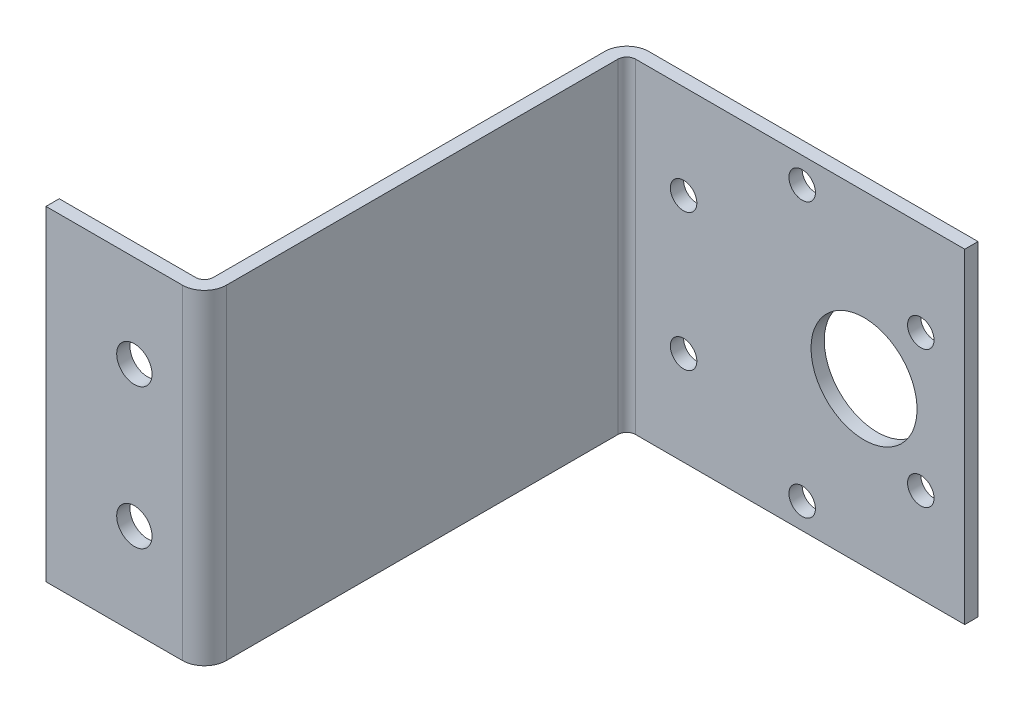
ISO-10303-21;
HEADER;
FILE_DESCRIPTION(('STEP AP214'),'2;1');
FILE_NAME('part.step','',(''),(''),'','','');
FILE_SCHEMA(('AUTOMOTIVE_DESIGN { 1 0 10303 214 1 1 1 1 }'));
ENDSEC;
DATA;
#1=APPLICATION_CONTEXT('core data for automotive mechanical design processes');
#2=APPLICATION_PROTOCOL_DEFINITION('international standard','automotive_design',2000,#1);
#3=PRODUCT_CONTEXT('',#1,'mechanical');
#4=PRODUCT('Part','Part','',(#3));
#5=PRODUCT_RELATED_PRODUCT_CATEGORY('part','',(#4));
#6=PRODUCT_DEFINITION_FORMATION('','',#4);
#7=PRODUCT_DEFINITION_CONTEXT('part definition',#1,'design');
#8=PRODUCT_DEFINITION('design','',#6,#7);
#9=PRODUCT_DEFINITION_SHAPE('','',#8);
#10=(LENGTH_UNIT() NAMED_UNIT(*) SI_UNIT(.MILLI.,.METRE.));
#11=(NAMED_UNIT(*) PLANE_ANGLE_UNIT() SI_UNIT($,.RADIAN.));
#12=(NAMED_UNIT(*) SI_UNIT($,.STERADIAN.) SOLID_ANGLE_UNIT());
#13=UNCERTAINTY_MEASURE_WITH_UNIT(LENGTH_MEASURE(1.E-05),#10,'distance_accuracy_value','');
#14=(GEOMETRIC_REPRESENTATION_CONTEXT(3) GLOBAL_UNCERTAINTY_ASSIGNED_CONTEXT((#13)) GLOBAL_UNIT_ASSIGNED_CONTEXT((#10,
#11,#12)) REPRESENTATION_CONTEXT('',''));
#15=CARTESIAN_POINT('',(0.,0.,0.));
#16=DIRECTION('',(0.,0.,1.));
#17=DIRECTION('',(1.,0.,0.));
#18=AXIS2_PLACEMENT_3D('',#15,#16,#17);
#19=CARTESIAN_POINT('',(-864.924391980611,18.4,1.5));
#20=DIRECTION('',(-1.,0.,0.));
#21=DIRECTION('',(0.,0.,1.));
#22=AXIS2_PLACEMENT_3D('',#19,#20,#21);
#23=PLANE('',#22);
#24=DIRECTION('',(0.,0.,-1.));
#25=VECTOR('',#24,1.);
#26=CARTESIAN_POINT('',(-864.924391980611,-18.4,1.5));
#27=LINE('',#26,#25);
#28=CARTESIAN_POINT('',(-864.924391980611,-18.4,1.5));
#29=VERTEX_POINT('',#28);
#30=CARTESIAN_POINT('',(-864.924391980611,-18.4,0.));
#31=VERTEX_POINT('',#30);
#32=EDGE_CURVE('E139',#29,#31,#27,.T.);
#33=ORIENTED_EDGE('',*,*,#32,.T.);
#34=DIRECTION('',(0.,-1.,0.));
#35=VECTOR('',#34,1.);
#36=CARTESIAN_POINT('',(-864.924391980611,18.4,0.));
#37=LINE('',#36,#35);
#38=CARTESIAN_POINT('',(-864.924391980611,18.4,0.));
#39=VERTEX_POINT('',#38);
#40=EDGE_CURVE('E123',#39,#31,#37,.T.);
#41=ORIENTED_EDGE('',*,*,#40,.F.);
#42=DIRECTION('',(0.,0.,-1.));
#43=VECTOR('',#42,1.);
#44=CARTESIAN_POINT('',(-864.924391980611,18.4,1.5));
#45=LINE('',#44,#43);
#46=CARTESIAN_POINT('',(-864.924391980611,18.4,1.5));
#47=VERTEX_POINT('',#46);
#48=EDGE_CURVE('E126',#47,#39,#45,.T.);
#49=ORIENTED_EDGE('',*,*,#48,.F.);
#50=DIRECTION('',(0.,-1.,0.));
#51=VECTOR('',#50,1.);
#52=CARTESIAN_POINT('',(-864.924391980611,18.4,1.5));
#53=LINE('',#52,#51);
#54=EDGE_CURVE('E230',#47,#29,#53,.T.);
#55=ORIENTED_EDGE('',*,*,#54,.T.);
#56=EDGE_LOOP('',(#33,#41,#49,#55));
#57=FACE_BOUND('',#56,.T.);
#58=ADVANCED_FACE('F33',(#57),#23,.F.);
#59=CARTESIAN_POINT('',(-864.924391980611,18.4,0.));
#60=DIRECTION('',(6.16124264811828E-13,0.,1.));
#61=DIRECTION('',(1.,0.,-6.16124264811828E-13));
#62=AXIS2_PLACEMENT_3D('',#59,#60,#61);
#63=PLANE('',#62);
#64=CARTESIAN_POINT('',(-896.74778573927,7.75000000000018,0.));
#65=DIRECTION('',(0.,0.,-1.));
#66=DIRECTION('',(-1.,0.,0.));
#67=AXIS2_PLACEMENT_3D('',#64,#65,#66);
#68=CIRCLE('',#67,1.50000000000043);
#69=CARTESIAN_POINT('',(-898.24778573927,7.75000000000018,0.));
#70=VERTEX_POINT('',#69);
#71=EDGE_CURVE('E499',#70,#70,#68,.T.);
#72=ORIENTED_EDGE('',*,*,#71,.F.);
#73=EDGE_LOOP('',(#72));
#74=FACE_BOUND('',#73,.T.);
#75=CARTESIAN_POINT('',(-869.900998221952,-7.75,0.));
#76=DIRECTION('',(0.,0.,-1.));
#77=DIRECTION('',(-1.,0.,0.));
#78=AXIS2_PLACEMENT_3D('',#75,#76,#77);
#79=CIRCLE('',#78,1.50000000000008);
#80=CARTESIAN_POINT('',(-871.400998221952,-7.75,0.));
#81=VERTEX_POINT('',#80);
#82=EDGE_CURVE('E503',#81,#81,#79,.T.);
#83=ORIENTED_EDGE('',*,*,#82,.F.);
#84=EDGE_LOOP('',(#83));
#85=FACE_BOUND('',#84,.T.);
#86=CARTESIAN_POINT('',(-896.74778573927,-7.74999999999983,0.));
#87=DIRECTION('',(0.,0.,-1.));
#88=DIRECTION('',(-1.,0.,0.));
#89=AXIS2_PLACEMENT_3D('',#86,#87,#88);
#90=CIRCLE('',#89,1.5000000000002);
#91=CARTESIAN_POINT('',(-898.24778573927,-7.74999999999983,0.));
#92=VERTEX_POINT('',#91);
#93=EDGE_CURVE('E515',#92,#92,#90,.T.);
#94=ORIENTED_EDGE('',*,*,#93,.F.);
#95=EDGE_LOOP('',(#94));
#96=FACE_BOUND('',#95,.T.);
#97=CARTESIAN_POINT('',(-883.324391980611,-15.4999999999999,0.));
#98=DIRECTION('',(0.,0.,-1.));
#99=DIRECTION('',(-1.,0.,0.));
#100=AXIS2_PLACEMENT_3D('',#97,#98,#99);
#101=CIRCLE('',#100,1.49999999999997);
#102=CARTESIAN_POINT('',(-884.824391980611,-15.4999999999999,0.));
#103=VERTEX_POINT('',#102);
#104=EDGE_CURVE('E517',#103,#103,#101,.T.);
#105=ORIENTED_EDGE('',*,*,#104,.F.);
#106=EDGE_LOOP('',(#105));
#107=FACE_BOUND('',#106,.T.);
#108=CARTESIAN_POINT('',(-883.324391980611,15.5,0.));
#109=DIRECTION('',(0.,0.,-1.));
#110=DIRECTION('',(-1.,0.,0.));
#111=AXIS2_PLACEMENT_3D('',#108,#109,#110);
#112=CIRCLE('',#111,1.50000000000066);
#113=CARTESIAN_POINT('',(-884.824391980611,15.5,0.));
#114=VERTEX_POINT('',#113);
#115=EDGE_CURVE('E352',#114,#114,#112,.T.);
#116=ORIENTED_EDGE('',*,*,#115,.F.);
#117=EDGE_LOOP('',(#116));
#118=FACE_BOUND('',#117,.T.);
#119=CARTESIAN_POINT('',(-869.900998221952,7.75,0.));
#120=DIRECTION('',(0.,0.,-1.));
#121=DIRECTION('',(-1.,0.,0.));
#122=AXIS2_PLACEMENT_3D('',#119,#120,#121);
#123=CIRCLE('',#122,1.5000000000002);
#124=CARTESIAN_POINT('',(-871.400998221952,7.75,0.));
#125=VERTEX_POINT('',#124);
#126=EDGE_CURVE('E500',#125,#125,#123,.T.);
#127=ORIENTED_EDGE('',*,*,#126,.F.);
#128=EDGE_LOOP('',(#127));
#129=FACE_BOUND('',#128,.T.);
#130=CARTESIAN_POINT('',(-876.324391980611,0.,0.));
#131=DIRECTION('',(0.,0.,-1.));
#132=DIRECTION('',(-1.,0.,0.));
#133=AXIS2_PLACEMENT_3D('',#130,#131,#132);
#134=CIRCLE('',#133,5.99999999999999);
#135=CARTESIAN_POINT('',(-882.324391980611,0.,0.));
#136=VERTEX_POINT('',#135);
#137=EDGE_CURVE('E155',#136,#136,#134,.T.);
#138=ORIENTED_EDGE('',*,*,#137,.F.);
#139=EDGE_LOOP('',(#138));
#140=FACE_BOUND('',#139,.T.);
#141=DIRECTION('',(-1.,0.,6.16124264811828E-13));
#142=VECTOR('',#141,1.);
#143=CARTESIAN_POINT('',(-864.924391980611,-18.4,0.));
#144=LINE('',#143,#142);
#145=CARTESIAN_POINT('',(-902.179838859942,-18.4,2.29539848187639E-11));
#146=VERTEX_POINT('',#145);
#147=EDGE_CURVE('E216',#31,#146,#144,.T.);
#148=ORIENTED_EDGE('',*,*,#147,.T.);
#149=DIRECTION('',(0.,-1.,0.));
#150=VECTOR('',#149,1.);
#151=CARTESIAN_POINT('',(-902.179838859942,18.4,2.29539848187639E-11));
#152=LINE('',#151,#150);
#153=CARTESIAN_POINT('',(-902.179838859942,18.4,2.29539848187639E-11));
#154=VERTEX_POINT('',#153);
#155=EDGE_CURVE('E11',#146,#154,#152,.F.);
#156=ORIENTED_EDGE('',*,*,#155,.T.);
#157=DIRECTION('',(-1.,0.,6.16124264811828E-13));
#158=VECTOR('',#157,1.);
#159=CARTESIAN_POINT('',(-864.924391980611,18.4,0.));
#160=LINE('',#159,#158);
#161=EDGE_CURVE('E119',#39,#154,#160,.T.);
#162=ORIENTED_EDGE('',*,*,#161,.F.);
#163=ORIENTED_EDGE('',*,*,#40,.T.);
#164=EDGE_LOOP('',(#148,#156,#162,#163));
#165=FACE_BOUND('',#164,.T.);
#166=ADVANCED_FACE('F121',(#74,#85,#96,#107,#118,#129,#140,#165),#63,.F.);
#167=CARTESIAN_POINT('',(-904.67983885994,18.4,2.44942954807925E-11));
#168=DIRECTION('',(1.,0.,0.));
#169=DIRECTION('',(0.,0.,-1.));
#170=AXIS2_PLACEMENT_3D('',#167,#168,#169);
#171=PLANE('',#170);
#172=DIRECTION('',(0.,0.,1.));
#173=VECTOR('',#172,1.);
#174=CARTESIAN_POINT('',(-904.67983885994,18.4,2.44942954807925E-11));
#175=LINE('',#174,#173);
#176=CARTESIAN_POINT('',(-904.67983885994,18.4,2.50000000002295));
#177=VERTEX_POINT('',#176);
#178=CARTESIAN_POINT('',(-904.67983885994,18.4,46.8));
#179=VERTEX_POINT('',#178);
#180=EDGE_CURVE('E125',#177,#179,#175,.T.);
#181=ORIENTED_EDGE('',*,*,#180,.F.);
#182=DIRECTION('',(0.,-1.,0.));
#183=VECTOR('',#182,1.);
#184=CARTESIAN_POINT('',(-904.67983885994,18.4,2.50000000002295));
#185=LINE('',#184,#183);
#186=CARTESIAN_POINT('',(-904.67983885994,-18.4,2.50000000002295));
#187=VERTEX_POINT('',#186);
#188=EDGE_CURVE('E41',#177,#187,#185,.T.);
#189=ORIENTED_EDGE('',*,*,#188,.T.);
#190=DIRECTION('',(0.,0.,1.));
#191=VECTOR('',#190,1.);
#192=CARTESIAN_POINT('',(-904.67983885994,-18.4,2.44942954807925E-11));
#193=LINE('',#192,#191);
#194=CARTESIAN_POINT('',(-904.67983885994,-18.4,46.8));
#195=VERTEX_POINT('',#194);
#196=EDGE_CURVE('E208',#187,#195,#193,.T.);
#197=ORIENTED_EDGE('',*,*,#196,.T.);
#198=DIRECTION('',(0.,-1.,0.));
#199=VECTOR('',#198,1.);
#200=CARTESIAN_POINT('',(-904.67983885994,18.4,46.8));
#201=LINE('',#200,#199);
#202=EDGE_CURVE('E144',#195,#179,#201,.F.);
#203=ORIENTED_EDGE('',*,*,#202,.T.);
#204=EDGE_LOOP('',(#181,#189,#197,#203));
#205=FACE_BOUND('',#204,.T.);
#206=ADVANCED_FACE('F207',(#205),#171,.F.);
#207=CARTESIAN_POINT('',(-904.67983885994,18.4,47.8));
#208=DIRECTION('',(0.,0.,1.));
#209=DIRECTION('',(1.,0.,0.));
#210=AXIS2_PLACEMENT_3D('',#207,#208,#209);
#211=PLANE('',#210);
#212=CARTESIAN_POINT('',(-911.111891980611,-7.9375,47.8));
#213=DIRECTION('',(0.,0.,1.));
#214=DIRECTION('',(1.,0.,0.));
#215=AXIS2_PLACEMENT_3D('',#212,#213,#214);
#216=CIRCLE('',#215,2.);
#217=CARTESIAN_POINT('',(-909.111891980611,-7.9375,47.8));
#218=VERTEX_POINT('',#217);
#219=EDGE_CURVE('E257',#218,#218,#216,.T.);
#220=ORIENTED_EDGE('',*,*,#219,.T.);
#221=EDGE_LOOP('',(#220));
#222=FACE_BOUND('',#221,.T.);
#223=CARTESIAN_POINT('',(-911.111891980611,7.9375,47.8));
#224=DIRECTION('',(0.,0.,1.));
#225=DIRECTION('',(1.,0.,0.));
#226=AXIS2_PLACEMENT_3D('',#223,#224,#225);
#227=CIRCLE('',#226,2.);
#228=CARTESIAN_POINT('',(-909.111891980611,7.9375,47.8));
#229=VERTEX_POINT('',#228);
#230=EDGE_CURVE('E172',#229,#229,#227,.T.);
#231=ORIENTED_EDGE('',*,*,#230,.T.);
#232=EDGE_LOOP('',(#231));
#233=FACE_BOUND('',#232,.T.);
#234=DIRECTION('',(-1.,0.,0.));
#235=VECTOR('',#234,1.);
#236=CARTESIAN_POINT('',(-904.67983885994,18.4,47.8));
#237=LINE('',#236,#235);
#238=CARTESIAN_POINT('',(-905.67983885994,18.4,47.8));
#239=VERTEX_POINT('',#238);
#240=CARTESIAN_POINT('',(-921.111891980611,18.4,47.8));
#241=VERTEX_POINT('',#240);
#242=EDGE_CURVE('E267',#239,#241,#237,.T.);
#243=ORIENTED_EDGE('',*,*,#242,.F.);
#244=DIRECTION('',(0.,-1.,0.));
#245=VECTOR('',#244,1.);
#246=CARTESIAN_POINT('',(-905.67983885994,-18.4,47.8));
#247=LINE('',#246,#245);
#248=CARTESIAN_POINT('',(-905.67983885994,-18.4,47.8));
#249=VERTEX_POINT('',#248);
#250=EDGE_CURVE('E140',#239,#249,#247,.T.);
#251=ORIENTED_EDGE('',*,*,#250,.T.);
#252=DIRECTION('',(-1.,0.,0.));
#253=VECTOR('',#252,1.);
#254=CARTESIAN_POINT('',(-904.67983885994,-18.4,47.8));
#255=LINE('',#254,#253);
#256=CARTESIAN_POINT('',(-921.111891980611,-18.4,47.8));
#257=VERTEX_POINT('',#256);
#258=EDGE_CURVE('E215',#249,#257,#255,.T.);
#259=ORIENTED_EDGE('',*,*,#258,.T.);
#260=DIRECTION('',(0.,-1.,0.));
#261=VECTOR('',#260,1.);
#262=CARTESIAN_POINT('',(-921.111891980611,18.4,47.8));
#263=LINE('',#262,#261);
#264=EDGE_CURVE('E141',#241,#257,#263,.T.);
#265=ORIENTED_EDGE('',*,*,#264,.F.);
#266=EDGE_LOOP('',(#243,#251,#259,#265));
#267=FACE_BOUND('',#266,.T.);
#268=ADVANCED_FACE('F272',(#222,#233,#267),#211,.F.);
#269=CARTESIAN_POINT('',(-921.111891980611,18.4,47.8));
#270=DIRECTION('',(1.,0.,0.));
#271=DIRECTION('',(0.,0.,-1.));
#272=AXIS2_PLACEMENT_3D('',#269,#270,#271);
#273=PLANE('',#272);
#274=DIRECTION('',(0.,0.,1.));
#275=VECTOR('',#274,1.);
#276=CARTESIAN_POINT('',(-921.111891980611,-18.4,47.8));
#277=LINE('',#276,#275);
#278=CARTESIAN_POINT('',(-921.111891980611,-18.4,49.3));
#279=VERTEX_POINT('',#278);
#280=EDGE_CURVE('E218',#257,#279,#277,.T.);
#281=ORIENTED_EDGE('',*,*,#280,.T.);
#282=DIRECTION('',(0.,-1.,0.));
#283=VECTOR('',#282,1.);
#284=CARTESIAN_POINT('',(-921.111891980611,18.4,49.3));
#285=LINE('',#284,#283);
#286=CARTESIAN_POINT('',(-921.111891980611,18.4,49.3));
#287=VERTEX_POINT('',#286);
#288=EDGE_CURVE('E147',#287,#279,#285,.T.);
#289=ORIENTED_EDGE('',*,*,#288,.F.);
#290=DIRECTION('',(0.,0.,1.));
#291=VECTOR('',#290,1.);
#292=CARTESIAN_POINT('',(-921.111891980611,18.4,47.8));
#293=LINE('',#292,#291);
#294=EDGE_CURVE('E254',#241,#287,#293,.T.);
#295=ORIENTED_EDGE('',*,*,#294,.F.);
#296=ORIENTED_EDGE('',*,*,#264,.T.);
#297=EDGE_LOOP('',(#281,#289,#295,#296));
#298=FACE_BOUND('',#297,.T.);
#299=ADVANCED_FACE('F270',(#298),#273,.F.);
#300=CARTESIAN_POINT('',(-921.111891980611,18.4,49.3));
#301=DIRECTION('',(0.,0.,-1.));
#302=DIRECTION('',(-1.,0.,0.));
#303=AXIS2_PLACEMENT_3D('',#300,#301,#302);
#304=PLANE('',#303);
#305=CARTESIAN_POINT('',(-911.111891980611,-7.9375,49.3));
#306=DIRECTION('',(0.,0.,-1.));
#307=DIRECTION('',(-1.,0.,0.));
#308=AXIS2_PLACEMENT_3D('',#305,#306,#307);
#309=CIRCLE('',#308,2.);
#310=CARTESIAN_POINT('',(-913.111891980611,-7.9375,49.3));
#311=VERTEX_POINT('',#310);
#312=EDGE_CURVE('E506',#311,#311,#309,.T.);
#313=ORIENTED_EDGE('',*,*,#312,.T.);
#314=EDGE_LOOP('',(#313));
#315=FACE_BOUND('',#314,.T.);
#316=CARTESIAN_POINT('',(-911.111891980611,7.9375,49.3));
#317=DIRECTION('',(0.,0.,-1.));
#318=DIRECTION('',(-1.,0.,0.));
#319=AXIS2_PLACEMENT_3D('',#316,#317,#318);
#320=CIRCLE('',#319,2.);
#321=CARTESIAN_POINT('',(-913.111891980611,7.9375,49.3));
#322=VERTEX_POINT('',#321);
#323=EDGE_CURVE('E511',#322,#322,#320,.T.);
#324=ORIENTED_EDGE('',*,*,#323,.T.);
#325=EDGE_LOOP('',(#324));
#326=FACE_BOUND('',#325,.T.);
#327=DIRECTION('',(1.,0.,0.));
#328=VECTOR('',#327,1.);
#329=CARTESIAN_POINT('',(-921.111891980611,-18.4,49.3));
#330=LINE('',#329,#328);
#331=CARTESIAN_POINT('',(-905.67983885994,-18.4,49.3));
#332=VERTEX_POINT('',#331);
#333=EDGE_CURVE('E224',#279,#332,#330,.T.);
#334=ORIENTED_EDGE('',*,*,#333,.T.);
#335=DIRECTION('',(0.,-1.,0.));
#336=VECTOR('',#335,1.);
#337=CARTESIAN_POINT('',(-905.67983885994,18.4,49.3));
#338=LINE('',#337,#336);
#339=CARTESIAN_POINT('',(-905.67983885994,18.4,49.3));
#340=VERTEX_POINT('',#339);
#341=EDGE_CURVE('E199',#332,#340,#338,.F.);
#342=ORIENTED_EDGE('',*,*,#341,.T.);
#343=DIRECTION('',(1.,0.,0.));
#344=VECTOR('',#343,1.);
#345=CARTESIAN_POINT('',(-921.111891980611,18.4,49.3));
#346=LINE('',#345,#344);
#347=EDGE_CURVE('E238',#287,#340,#346,.T.);
#348=ORIENTED_EDGE('',*,*,#347,.F.);
#349=ORIENTED_EDGE('',*,*,#288,.T.);
#350=EDGE_LOOP('',(#334,#342,#348,#349));
#351=FACE_BOUND('',#350,.T.);
#352=ADVANCED_FACE('F236',(#315,#326,#351),#304,.F.);
#353=CARTESIAN_POINT('',(-903.17983885994,18.4,49.3));
#354=DIRECTION('',(-1.,0.,0.));
#355=DIRECTION('',(0.,0.,1.));
#356=AXIS2_PLACEMENT_3D('',#353,#354,#355);
#357=PLANE('',#356);
#358=DIRECTION('',(0.,0.,-1.));
#359=VECTOR('',#358,1.);
#360=CARTESIAN_POINT('',(-903.17983885994,18.4,49.3));
#361=LINE('',#360,#359);
#362=CARTESIAN_POINT('',(-903.17983885994,18.4,46.8));
#363=VERTEX_POINT('',#362);
#364=CARTESIAN_POINT('',(-903.17983885994,18.4,2.50000000002385));
#365=VERTEX_POINT('',#364);
#366=EDGE_CURVE('E249',#363,#365,#361,.T.);
#367=ORIENTED_EDGE('',*,*,#366,.F.);
#368=DIRECTION('',(0.,-1.,0.));
#369=VECTOR('',#368,1.);
#370=CARTESIAN_POINT('',(-903.17983885994,18.4,46.8));
#371=LINE('',#370,#369);
#372=CARTESIAN_POINT('',(-903.17983885994,-18.4,46.8));
#373=VERTEX_POINT('',#372);
#374=EDGE_CURVE('E192',#363,#373,#371,.T.);
#375=ORIENTED_EDGE('',*,*,#374,.T.);
#376=DIRECTION('',(0.,0.,-1.));
#377=VECTOR('',#376,1.);
#378=CARTESIAN_POINT('',(-903.17983885994,-18.4,49.3));
#379=LINE('',#378,#377);
#380=CARTESIAN_POINT('',(-903.17983885994,-18.4,2.50000000002385));
#381=VERTEX_POINT('',#380);
#382=EDGE_CURVE('E227',#373,#381,#379,.T.);
#383=ORIENTED_EDGE('',*,*,#382,.T.);
#384=DIRECTION('',(0.,-1.,0.));
#385=VECTOR('',#384,1.);
#386=CARTESIAN_POINT('',(-903.17983885994,18.4,2.50000000002385));
#387=LINE('',#386,#385);
#388=EDGE_CURVE('E179',#381,#365,#387,.F.);
#389=ORIENTED_EDGE('',*,*,#388,.T.);
#390=EDGE_LOOP('',(#367,#375,#383,#389));
#391=FACE_BOUND('',#390,.T.);
#392=ADVANCED_FACE('F248',(#391),#357,.F.);
#393=CARTESIAN_POINT('',(-903.17983885994,18.4,1.50000000002449));
#394=DIRECTION('',(-6.40248551152591E-13,0.,-1.));
#395=DIRECTION('',(-1.,0.,6.40248551152591E-13));
#396=AXIS2_PLACEMENT_3D('',#393,#394,#395);
#397=PLANE('',#396);
#398=CARTESIAN_POINT('',(-896.74778573927,7.75000000000018,1.50000000002038));
#399=DIRECTION('',(-6.40248551152591E-13,0.,-1.));
#400=DIRECTION('',(-1.,0.,6.40248551152591E-13));
#401=AXIS2_PLACEMENT_3D('',#398,#399,#400);
#402=CIRCLE('',#401,1.50000000000043);
#403=CARTESIAN_POINT('',(-898.24778573927,7.75000000000018,1.50000000002134));
#404=VERTEX_POINT('',#403);
#405=EDGE_CURVE('E170',#404,#404,#402,.T.);
#406=ORIENTED_EDGE('',*,*,#405,.T.);
#407=EDGE_LOOP('',(#406));
#408=FACE_BOUND('',#407,.T.);
#409=CARTESIAN_POINT('',(-869.900998221952,-7.75,1.50000000000319));
#410=DIRECTION('',(-6.40248551152591E-13,0.,-1.));
#411=DIRECTION('',(-1.,0.,6.40248551152591E-13));
#412=AXIS2_PLACEMENT_3D('',#409,#410,#411);
#413=CIRCLE('',#412,1.50000000000008);
#414=CARTESIAN_POINT('',(-871.400998221952,-7.75,1.50000000000415));
#415=VERTEX_POINT('',#414);
#416=EDGE_CURVE('E167',#415,#415,#413,.T.);
#417=ORIENTED_EDGE('',*,*,#416,.T.);
#418=EDGE_LOOP('',(#417));
#419=FACE_BOUND('',#418,.T.);
#420=CARTESIAN_POINT('',(-896.74778573927,-7.74999999999983,1.50000000002038));
#421=DIRECTION('',(-6.40248551152591E-13,0.,-1.));
#422=DIRECTION('',(-1.,0.,6.40248551152591E-13));
#423=AXIS2_PLACEMENT_3D('',#420,#421,#422);
#424=CIRCLE('',#423,1.5000000000002);
#425=CARTESIAN_POINT('',(-898.24778573927,-7.74999999999983,1.50000000002134));
#426=VERTEX_POINT('',#425);
#427=EDGE_CURVE('E164',#426,#426,#424,.T.);
#428=ORIENTED_EDGE('',*,*,#427,.T.);
#429=EDGE_LOOP('',(#428));
#430=FACE_BOUND('',#429,.T.);
#431=CARTESIAN_POINT('',(-883.324391980611,-15.4999999999999,1.50000000001178));
#432=DIRECTION('',(-6.40248551152591E-13,0.,-1.));
#433=DIRECTION('',(-1.,0.,6.40248551152591E-13));
#434=AXIS2_PLACEMENT_3D('',#431,#432,#433);
#435=CIRCLE('',#434,1.49999999999997);
#436=CARTESIAN_POINT('',(-884.824391980611,-15.4999999999999,1.50000000001274));
#437=VERTEX_POINT('',#436);
#438=EDGE_CURVE('E161',#437,#437,#435,.T.);
#439=ORIENTED_EDGE('',*,*,#438,.T.);
#440=EDGE_LOOP('',(#439));
#441=FACE_BOUND('',#440,.T.);
#442=CARTESIAN_POINT('',(-883.324391980611,15.5,1.50000000001178));
#443=DIRECTION('',(-6.40248551152591E-13,0.,-1.));
#444=DIRECTION('',(-1.,0.,6.40248551152591E-13));
#445=AXIS2_PLACEMENT_3D('',#442,#443,#444);
#446=CIRCLE('',#445,1.50000000000066);
#447=CARTESIAN_POINT('',(-884.824391980611,15.5,1.50000000001274));
#448=VERTEX_POINT('',#447);
#449=EDGE_CURVE('E158',#448,#448,#446,.T.);
#450=ORIENTED_EDGE('',*,*,#449,.T.);
#451=EDGE_LOOP('',(#450));
#452=FACE_BOUND('',#451,.T.);
#453=CARTESIAN_POINT('',(-869.900998221952,7.75,1.50000000000319));
#454=DIRECTION('',(-6.40248551152591E-13,0.,-1.));
#455=DIRECTION('',(-1.,0.,6.40248551152591E-13));
#456=AXIS2_PLACEMENT_3D('',#453,#454,#455);
#457=CIRCLE('',#456,1.5000000000002);
#458=CARTESIAN_POINT('',(-871.400998221952,7.75,1.50000000000415));
#459=VERTEX_POINT('',#458);
#460=EDGE_CURVE('E154',#459,#459,#457,.T.);
#461=ORIENTED_EDGE('',*,*,#460,.T.);
#462=EDGE_LOOP('',(#461));
#463=FACE_BOUND('',#462,.T.);
#464=CARTESIAN_POINT('',(-876.324391980611,0.,1.5000000000073));
#465=DIRECTION('',(-6.40248551152591E-13,0.,-1.));
#466=DIRECTION('',(-1.,0.,6.40248551152591E-13));
#467=AXIS2_PLACEMENT_3D('',#464,#465,#466);
#468=CIRCLE('',#467,5.99999999999999);
#469=CARTESIAN_POINT('',(-882.324391980611,0.,1.50000000001114));
#470=VERTEX_POINT('',#469);
#471=EDGE_CURVE('E151',#470,#470,#468,.T.);
#472=ORIENTED_EDGE('',*,*,#471,.T.);
#473=EDGE_LOOP('',(#472));
#474=FACE_BOUND('',#473,.T.);
#475=DIRECTION('',(1.,0.,-6.40248551152591E-13));
#476=VECTOR('',#475,1.);
#477=CARTESIAN_POINT('',(-903.17983885994,18.4,1.50000000002449));
#478=LINE('',#477,#476);
#479=CARTESIAN_POINT('',(-902.179838859941,18.4,1.50000000002385));
#480=VERTEX_POINT('',#479);
#481=EDGE_CURVE('E132',#480,#47,#478,.T.);
#482=ORIENTED_EDGE('',*,*,#481,.F.);
#483=DIRECTION('',(0.,-1.,0.));
#484=VECTOR('',#483,1.);
#485=CARTESIAN_POINT('',(-902.179838859941,-18.4,1.50000000002385));
#486=LINE('',#485,#484);
#487=CARTESIAN_POINT('',(-902.179838859941,-18.4,1.50000000002385));
#488=VERTEX_POINT('',#487);
#489=EDGE_CURVE('E176',#480,#488,#486,.T.);
#490=ORIENTED_EDGE('',*,*,#489,.T.);
#491=DIRECTION('',(1.,0.,-6.40248551152591E-13));
#492=VECTOR('',#491,1.);
#493=CARTESIAN_POINT('',(-903.17983885994,-18.4,1.50000000002449));
#494=LINE('',#493,#492);
#495=EDGE_CURVE('E136',#488,#29,#494,.T.);
#496=ORIENTED_EDGE('',*,*,#495,.T.);
#497=ORIENTED_EDGE('',*,*,#54,.F.);
#498=EDGE_LOOP('',(#482,#490,#496,#497));
#499=FACE_BOUND('',#498,.T.);
#500=ADVANCED_FACE('F309',(#408,#419,#430,#441,#452,#463,#474,#499),#397,.F.);
#501=CARTESIAN_POINT('',(0.,18.4,0.));
#502=DIRECTION('',(0.,1.,0.));
#503=DIRECTION('',(0.,0.,1.));
#504=AXIS2_PLACEMENT_3D('',#501,#502,#503);
#505=PLANE('',#504);
#506=ORIENTED_EDGE('',*,*,#347,.T.);
#507=CARTESIAN_POINT('',(-905.67983885994,18.4,46.8));
#508=DIRECTION('',(0.,1.,0.));
#509=DIRECTION('',(0.,0.,1.));
#510=AXIS2_PLACEMENT_3D('',#507,#508,#509);
#511=CIRCLE('',#510,2.5);
#512=EDGE_CURVE('E202',#340,#363,#511,.T.);
#513=ORIENTED_EDGE('',*,*,#512,.T.);
#514=ORIENTED_EDGE('',*,*,#366,.T.);
#515=CARTESIAN_POINT('',(-902.17983885994,18.4,2.50000000002385));
#516=DIRECTION('',(0.,1.,0.));
#517=DIRECTION('',(0.,0.,1.));
#518=AXIS2_PLACEMENT_3D('',#515,#516,#517);
#519=CIRCLE('',#518,1.);
#520=EDGE_CURVE('E190',#365,#480,#519,.F.);
#521=ORIENTED_EDGE('',*,*,#520,.T.);
#522=ORIENTED_EDGE('',*,*,#481,.T.);
#523=ORIENTED_EDGE('',*,*,#48,.T.);
#524=ORIENTED_EDGE('',*,*,#161,.T.);
#525=CARTESIAN_POINT('',(-902.17983885994,18.4,2.50000000002295));
#526=DIRECTION('',(0.,1.,0.));
#527=DIRECTION('',(0.,0.,1.));
#528=AXIS2_PLACEMENT_3D('',#525,#526,#527);
#529=CIRCLE('',#528,2.5);
#530=EDGE_CURVE('E48',#154,#177,#529,.T.);
#531=ORIENTED_EDGE('',*,*,#530,.T.);
#532=ORIENTED_EDGE('',*,*,#180,.T.);
#533=CARTESIAN_POINT('',(-905.67983885994,18.4,46.8));
#534=DIRECTION('',(0.,1.,0.));
#535=DIRECTION('',(0.,0.,1.));
#536=AXIS2_PLACEMENT_3D('',#533,#534,#535);
#537=CIRCLE('',#536,1.);
#538=EDGE_CURVE('E185',#179,#239,#537,.F.);
#539=ORIENTED_EDGE('',*,*,#538,.T.);
#540=ORIENTED_EDGE('',*,*,#242,.T.);
#541=ORIENTED_EDGE('',*,*,#294,.T.);
#542=EDGE_LOOP('',(#506,#513,#514,#521,#522,#523,#524,#531,#532,#539,#540,#541));
#543=FACE_BOUND('',#542,.T.);
#544=ADVANCED_FACE('F130',(#543),#505,.T.);
#545=CARTESIAN_POINT('',(0.,-18.4,0.));
#546=DIRECTION('',(0.,1.,0.));
#547=DIRECTION('',(0.,0.,1.));
#548=AXIS2_PLACEMENT_3D('',#545,#546,#547);
#549=PLANE('',#548);
#550=ORIENTED_EDGE('',*,*,#382,.F.);
#551=CARTESIAN_POINT('',(-905.67983885994,-18.4,46.8));
#552=DIRECTION('',(0.,1.,0.));
#553=DIRECTION('',(0.,0.,1.));
#554=AXIS2_PLACEMENT_3D('',#551,#552,#553);
#555=CIRCLE('',#554,2.5);
#556=EDGE_CURVE('E197',#373,#332,#555,.F.);
#557=ORIENTED_EDGE('',*,*,#556,.T.);
#558=ORIENTED_EDGE('',*,*,#333,.F.);
#559=ORIENTED_EDGE('',*,*,#280,.F.);
#560=ORIENTED_EDGE('',*,*,#258,.F.);
#561=CARTESIAN_POINT('',(-905.67983885994,-18.4,46.8));
#562=DIRECTION('',(0.,1.,0.));
#563=DIRECTION('',(0.,0.,1.));
#564=AXIS2_PLACEMENT_3D('',#561,#562,#563);
#565=CIRCLE('',#564,1.);
#566=EDGE_CURVE('E182',#249,#195,#565,.T.);
#567=ORIENTED_EDGE('',*,*,#566,.T.);
#568=ORIENTED_EDGE('',*,*,#196,.F.);
#569=CARTESIAN_POINT('',(-902.17983885994,-18.4,2.50000000002295));
#570=DIRECTION('',(0.,1.,0.));
#571=DIRECTION('',(0.,0.,1.));
#572=AXIS2_PLACEMENT_3D('',#569,#570,#571);
#573=CIRCLE('',#572,2.5);
#574=EDGE_CURVE('E195',#187,#146,#573,.F.);
#575=ORIENTED_EDGE('',*,*,#574,.T.);
#576=ORIENTED_EDGE('',*,*,#147,.F.);
#577=ORIENTED_EDGE('',*,*,#32,.F.);
#578=ORIENTED_EDGE('',*,*,#495,.F.);
#579=CARTESIAN_POINT('',(-902.17983885994,-18.4,2.50000000002385));
#580=DIRECTION('',(0.,1.,0.));
#581=DIRECTION('',(0.,0.,1.));
#582=AXIS2_PLACEMENT_3D('',#579,#580,#581);
#583=CIRCLE('',#582,1.);
#584=EDGE_CURVE('E187',#488,#381,#583,.T.);
#585=ORIENTED_EDGE('',*,*,#584,.T.);
#586=EDGE_LOOP('',(#550,#557,#558,#559,#560,#567,#568,#575,#576,#577,#578,#585));
#587=FACE_BOUND('',#586,.T.);
#588=ADVANCED_FACE('F212',(#587),#549,.F.);
#589=CARTESIAN_POINT('',(-876.324391980611,0.,49.3));
#590=DIRECTION('',(0.,0.,-1.));
#591=DIRECTION('',(-1.,0.,0.));
#592=AXIS2_PLACEMENT_3D('',#589,#590,#591);
#593=CYLINDRICAL_SURFACE('',#592,5.99999999999999);
#594=ORIENTED_EDGE('',*,*,#137,.T.);
#595=EDGE_LOOP('',(#594));
#596=FACE_BOUND('',#595,.T.);
#597=ORIENTED_EDGE('',*,*,#471,.F.);
#598=EDGE_LOOP('',(#597));
#599=FACE_BOUND('',#598,.T.);
#600=ADVANCED_FACE('F315',(#596,#599),#593,.F.);
#601=CARTESIAN_POINT('',(-869.900998221952,7.75,49.3));
#602=DIRECTION('',(0.,0.,-1.));
#603=DIRECTION('',(-1.,0.,0.));
#604=AXIS2_PLACEMENT_3D('',#601,#602,#603);
#605=CYLINDRICAL_SURFACE('',#604,1.5000000000002);
#606=ORIENTED_EDGE('',*,*,#126,.T.);
#607=EDGE_LOOP('',(#606));
#608=FACE_BOUND('',#607,.T.);
#609=ORIENTED_EDGE('',*,*,#460,.F.);
#610=EDGE_LOOP('',(#609));
#611=FACE_BOUND('',#610,.T.);
#612=ADVANCED_FACE('F320',(#608,#611),#605,.F.);
#613=CARTESIAN_POINT('',(-883.324391980611,15.5,49.3));
#614=DIRECTION('',(0.,0.,-1.));
#615=DIRECTION('',(-1.,0.,0.));
#616=AXIS2_PLACEMENT_3D('',#613,#614,#615);
#617=CYLINDRICAL_SURFACE('',#616,1.50000000000066);
#618=ORIENTED_EDGE('',*,*,#115,.T.);
#619=EDGE_LOOP('',(#618));
#620=FACE_BOUND('',#619,.T.);
#621=ORIENTED_EDGE('',*,*,#449,.F.);
#622=EDGE_LOOP('',(#621));
#623=FACE_BOUND('',#622,.T.);
#624=ADVANCED_FACE('F330',(#620,#623),#617,.F.);
#625=CARTESIAN_POINT('',(-883.324391980611,-15.4999999999999,49.3));
#626=DIRECTION('',(0.,0.,-1.));
#627=DIRECTION('',(-1.,0.,0.));
#628=AXIS2_PLACEMENT_3D('',#625,#626,#627);
#629=CYLINDRICAL_SURFACE('',#628,1.49999999999997);
#630=ORIENTED_EDGE('',*,*,#104,.T.);
#631=EDGE_LOOP('',(#630));
#632=FACE_BOUND('',#631,.T.);
#633=ORIENTED_EDGE('',*,*,#438,.F.);
#634=EDGE_LOOP('',(#633));
#635=FACE_BOUND('',#634,.T.);
#636=ADVANCED_FACE('F326',(#632,#635),#629,.F.);
#637=CARTESIAN_POINT('',(-896.74778573927,-7.74999999999983,49.3));
#638=DIRECTION('',(0.,0.,-1.));
#639=DIRECTION('',(-1.,0.,0.));
#640=AXIS2_PLACEMENT_3D('',#637,#638,#639);
#641=CYLINDRICAL_SURFACE('',#640,1.5000000000002);
#642=ORIENTED_EDGE('',*,*,#93,.T.);
#643=EDGE_LOOP('',(#642));
#644=FACE_BOUND('',#643,.T.);
#645=ORIENTED_EDGE('',*,*,#427,.F.);
#646=EDGE_LOOP('',(#645));
#647=FACE_BOUND('',#646,.T.);
#648=ADVANCED_FACE('F322',(#644,#647),#641,.F.);
#649=CARTESIAN_POINT('',(-869.900998221952,-7.75,49.3));
#650=DIRECTION('',(0.,0.,-1.));
#651=DIRECTION('',(-1.,0.,0.));
#652=AXIS2_PLACEMENT_3D('',#649,#650,#651);
#653=CYLINDRICAL_SURFACE('',#652,1.50000000000008);
#654=ORIENTED_EDGE('',*,*,#82,.T.);
#655=EDGE_LOOP('',(#654));
#656=FACE_BOUND('',#655,.T.);
#657=ORIENTED_EDGE('',*,*,#416,.F.);
#658=EDGE_LOOP('',(#657));
#659=FACE_BOUND('',#658,.T.);
#660=ADVANCED_FACE('F325',(#656,#659),#653,.F.);
#661=CARTESIAN_POINT('',(-896.74778573927,7.75000000000018,49.3));
#662=DIRECTION('',(0.,0.,-1.));
#663=DIRECTION('',(-1.,0.,0.));
#664=AXIS2_PLACEMENT_3D('',#661,#662,#663);
#665=CYLINDRICAL_SURFACE('',#664,1.50000000000043);
#666=ORIENTED_EDGE('',*,*,#71,.T.);
#667=EDGE_LOOP('',(#666));
#668=FACE_BOUND('',#667,.T.);
#669=ORIENTED_EDGE('',*,*,#405,.F.);
#670=EDGE_LOOP('',(#669));
#671=FACE_BOUND('',#670,.T.);
#672=ADVANCED_FACE('F332',(#668,#671),#665,.F.);
#673=CARTESIAN_POINT('',(-911.111891980611,7.9375,49.3));
#674=DIRECTION('',(0.,0.,-1.));
#675=DIRECTION('',(-1.,0.,0.));
#676=AXIS2_PLACEMENT_3D('',#673,#674,#675);
#677=CYLINDRICAL_SURFACE('',#676,2.);
#678=ORIENTED_EDGE('',*,*,#323,.F.);
#679=EDGE_LOOP('',(#678));
#680=FACE_BOUND('',#679,.T.);
#681=ORIENTED_EDGE('',*,*,#230,.F.);
#682=EDGE_LOOP('',(#681));
#683=FACE_BOUND('',#682,.T.);
#684=ADVANCED_FACE('F287',(#680,#683),#677,.F.);
#685=CARTESIAN_POINT('',(-911.111891980611,-7.9375,49.3));
#686=DIRECTION('',(0.,0.,-1.));
#687=DIRECTION('',(-1.,0.,0.));
#688=AXIS2_PLACEMENT_3D('',#685,#686,#687);
#689=CYLINDRICAL_SURFACE('',#688,2.);
#690=ORIENTED_EDGE('',*,*,#312,.F.);
#691=EDGE_LOOP('',(#690));
#692=FACE_BOUND('',#691,.T.);
#693=ORIENTED_EDGE('',*,*,#219,.F.);
#694=EDGE_LOOP('',(#693));
#695=FACE_BOUND('',#694,.T.);
#696=ADVANCED_FACE('F279',(#692,#695),#689,.F.);
#697=CARTESIAN_POINT('',(-905.67983885994,18.4,46.8));
#698=DIRECTION('',(0.,1.,0.));
#699=DIRECTION('',(0.,0.,1.));
#700=AXIS2_PLACEMENT_3D('',#697,#698,#699);
#701=CYLINDRICAL_SURFACE('',#700,1.);
#702=ORIENTED_EDGE('',*,*,#538,.F.);
#703=ORIENTED_EDGE('',*,*,#202,.F.);
#704=ORIENTED_EDGE('',*,*,#566,.F.);
#705=ORIENTED_EDGE('',*,*,#250,.F.);
#706=EDGE_LOOP('',(#702,#703,#704,#705));
#707=FACE_BOUND('',#706,.T.);
#708=ADVANCED_FACE('F276',(#707),#701,.F.);
#709=CARTESIAN_POINT('',(-902.17983885994,18.4,2.50000000002385));
#710=DIRECTION('',(0.,1.,0.));
#711=DIRECTION('',(0.,0.,1.));
#712=AXIS2_PLACEMENT_3D('',#709,#710,#711);
#713=CYLINDRICAL_SURFACE('',#712,1.);
#714=ORIENTED_EDGE('',*,*,#520,.F.);
#715=ORIENTED_EDGE('',*,*,#388,.F.);
#716=ORIENTED_EDGE('',*,*,#584,.F.);
#717=ORIENTED_EDGE('',*,*,#489,.F.);
#718=EDGE_LOOP('',(#714,#715,#716,#717));
#719=FACE_BOUND('',#718,.T.);
#720=ADVANCED_FACE('F278',(#719),#713,.F.);
#721=CARTESIAN_POINT('',(-905.67983885994,18.4,46.8));
#722=DIRECTION('',(0.,-1.,0.));
#723=DIRECTION('',(0.,0.,-1.));
#724=AXIS2_PLACEMENT_3D('',#721,#722,#723);
#725=CYLINDRICAL_SURFACE('',#724,2.5);
#726=ORIENTED_EDGE('',*,*,#512,.F.);
#727=ORIENTED_EDGE('',*,*,#341,.F.);
#728=ORIENTED_EDGE('',*,*,#556,.F.);
#729=ORIENTED_EDGE('',*,*,#374,.F.);
#730=EDGE_LOOP('',(#726,#727,#728,#729));
#731=FACE_BOUND('',#730,.T.);
#732=ADVANCED_FACE('F245',(#731),#725,.T.);
#733=CARTESIAN_POINT('',(-902.17983885994,18.4,2.50000000002295));
#734=DIRECTION('',(0.,-1.,0.));
#735=DIRECTION('',(0.,0.,-1.));
#736=AXIS2_PLACEMENT_3D('',#733,#734,#735);
#737=CYLINDRICAL_SURFACE('',#736,2.5);
#738=ORIENTED_EDGE('',*,*,#530,.F.);
#739=ORIENTED_EDGE('',*,*,#155,.F.);
#740=ORIENTED_EDGE('',*,*,#574,.F.);
#741=ORIENTED_EDGE('',*,*,#188,.F.);
#742=EDGE_LOOP('',(#738,#739,#740,#741));
#743=FACE_BOUND('',#742,.T.);
#744=ADVANCED_FACE('F35',(#743),#737,.T.);
#745=CLOSED_SHELL('',(#58,#166,#206,#268,#299,#352,#392,#500,#544,#588,#600,#612,#624,#636,#648,
#660,#672,#684,#696,#708,#720,#732,#744));
#746=MANIFOLD_SOLID_BREP('B2',#745);
#747=ADVANCED_BREP_SHAPE_REPRESENTATION('',(#18,#746),#14);
#748=SHAPE_DEFINITION_REPRESENTATION(#9,#747);
ENDSEC;
END-ISO-10303-21;
